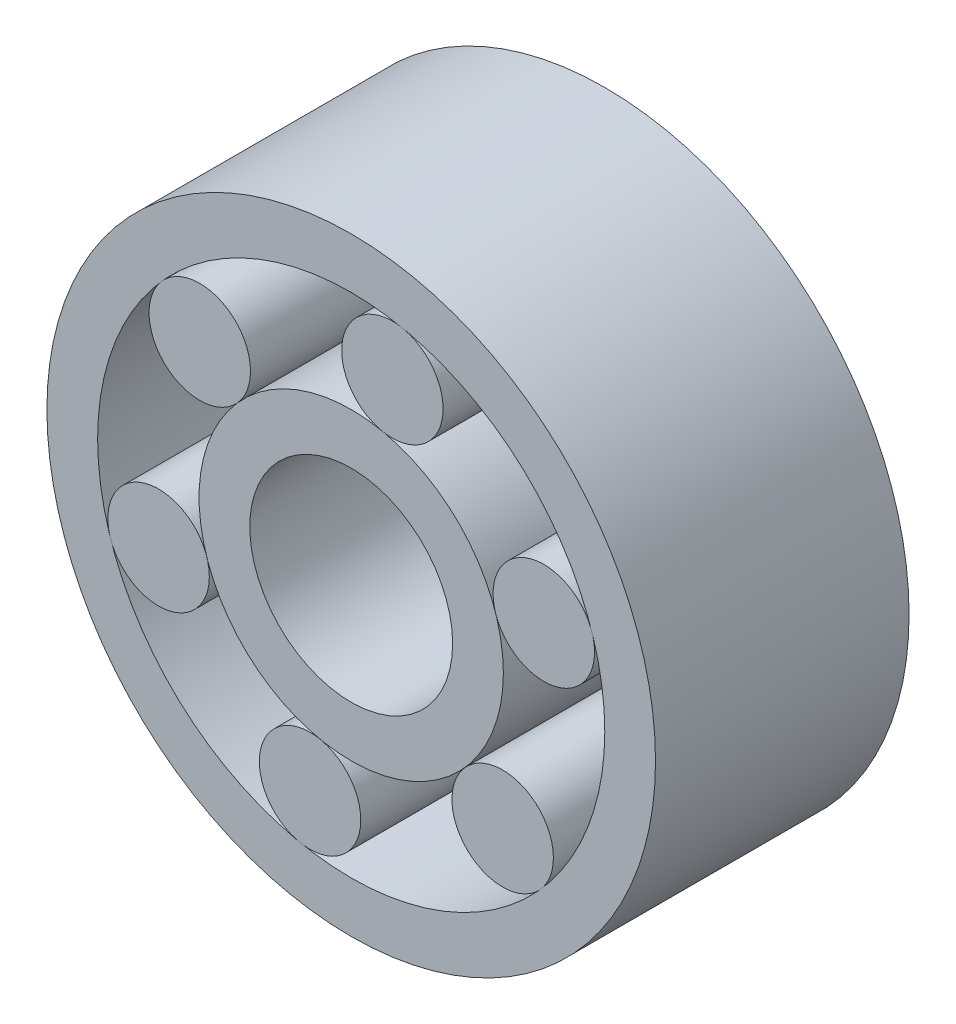
ISO-10303-21;
HEADER;
FILE_DESCRIPTION(('STEP AP214'),'2;1');
FILE_NAME('part.step','',(''),(''),'','','');
FILE_SCHEMA(('AUTOMOTIVE_DESIGN { 1 0 10303 214 1 1 1 1 }'));
ENDSEC;
DATA;
#1=APPLICATION_CONTEXT('core data for automotive mechanical design processes');
#2=APPLICATION_PROTOCOL_DEFINITION('international standard','automotive_design',2000,#1);
#3=PRODUCT_CONTEXT('',#1,'mechanical');
#4=PRODUCT('Part','Part','',(#3));
#5=PRODUCT_RELATED_PRODUCT_CATEGORY('part','',(#4));
#6=PRODUCT_DEFINITION_FORMATION('','',#4);
#7=PRODUCT_DEFINITION_CONTEXT('part definition',#1,'design');
#8=PRODUCT_DEFINITION('design','',#6,#7);
#9=PRODUCT_DEFINITION_SHAPE('','',#8);
#10=(LENGTH_UNIT() NAMED_UNIT(*) SI_UNIT(.MILLI.,.METRE.));
#11=(NAMED_UNIT(*) PLANE_ANGLE_UNIT() SI_UNIT($,.RADIAN.));
#12=(NAMED_UNIT(*) SI_UNIT($,.STERADIAN.) SOLID_ANGLE_UNIT());
#13=UNCERTAINTY_MEASURE_WITH_UNIT(LENGTH_MEASURE(1.E-05),#10,'distance_accuracy_value','');
#14=(GEOMETRIC_REPRESENTATION_CONTEXT(3) GLOBAL_UNCERTAINTY_ASSIGNED_CONTEXT((#13)) GLOBAL_UNIT_ASSIGNED_CONTEXT((#10,
#11,#12)) REPRESENTATION_CONTEXT('',''));
#15=CARTESIAN_POINT('',(0.,0.,0.));
#16=DIRECTION('',(0.,0.,1.));
#17=DIRECTION('',(1.,0.,0.));
#18=AXIS2_PLACEMENT_3D('',#15,#16,#17);
#19=CARTESIAN_POINT('',(-1.89893700826541,-0.627724651929273,2.5));
#20=DIRECTION('',(0.,0.,-1.));
#21=DIRECTION('',(-1.,0.,0.));
#22=AXIS2_PLACEMENT_3D('',#19,#20,#21);
#23=CYLINDRICAL_SURFACE('',#22,0.50000000000002);
#24=CARTESIAN_POINT('',(-1.89893700826541,-0.627724651929273,2.5));
#25=DIRECTION('',(0.,0.,1.));
#26=DIRECTION('',(1.,0.,0.));
#27=AXIS2_PLACEMENT_3D('',#24,#25,#26);
#28=CIRCLE('',#27,0.50000000000002);
#29=CARTESIAN_POINT('',(-1.39893700826539,-0.627724651929273,2.5));
#30=VERTEX_POINT('',#29);
#31=EDGE_CURVE('E12',#30,#30,#28,.T.);
#32=ORIENTED_EDGE('',*,*,#31,.F.);
#33=EDGE_LOOP('',(#32));
#34=FACE_BOUND('',#33,.T.);
#35=CARTESIAN_POINT('',(-1.89893700826541,-0.627724651929273,0.));
#36=DIRECTION('',(0.,0.,1.));
#37=DIRECTION('',(1.,0.,0.));
#38=AXIS2_PLACEMENT_3D('',#35,#36,#37);
#39=CIRCLE('',#38,0.50000000000002);
#40=CARTESIAN_POINT('',(-1.39893700826539,-0.627724651929273,0.));
#41=VERTEX_POINT('',#40);
#42=EDGE_CURVE('E57',#41,#41,#39,.T.);
#43=ORIENTED_EDGE('',*,*,#42,.T.);
#44=EDGE_LOOP('',(#43));
#45=FACE_BOUND('',#44,.T.);
#46=ADVANCED_FACE('F54',(#34,#45),#23,.T.);
#47=CARTESIAN_POINT('',(-1.89893700826541,-0.627724651929273,2.5));
#48=DIRECTION('',(0.,0.,1.));
#49=DIRECTION('',(1.,0.,0.));
#50=AXIS2_PLACEMENT_3D('',#47,#48,#49);
#51=PLANE('',#50);
#52=ORIENTED_EDGE('',*,*,#31,.T.);
#53=EDGE_LOOP('',(#52));
#54=FACE_BOUND('',#53,.T.);
#55=ADVANCED_FACE('F69',(#54),#51,.T.);
#56=CARTESIAN_POINT('',(-1.89893700826541,-0.627724651929273,0.));
#57=DIRECTION('',(0.,0.,1.));
#58=DIRECTION('',(1.,0.,0.));
#59=AXIS2_PLACEMENT_3D('',#56,#57,#58);
#60=PLANE('',#59);
#61=ORIENTED_EDGE('',*,*,#42,.F.);
#62=EDGE_LOOP('',(#61));
#63=FACE_BOUND('',#62,.T.);
#64=ADVANCED_FACE('F67',(#63),#60,.F.);
#65=CLOSED_SHELL('',(#46,#55,#64));
#66=MANIFOLD_SOLID_BREP('B2',#65);
#67=CARTESIAN_POINT('',(-0.405843008980126,-1.95839001530892,2.5));
#68=DIRECTION('',(0.,0.,-1.));
#69=DIRECTION('',(-1.,0.,0.));
#70=AXIS2_PLACEMENT_3D('',#67,#68,#69);
#71=CYLINDRICAL_SURFACE('',#70,0.500000000000088);
#72=CARTESIAN_POINT('',(-0.405843008980126,-1.95839001530892,2.5));
#73=DIRECTION('',(0.,0.,1.));
#74=DIRECTION('',(1.,0.,0.));
#75=AXIS2_PLACEMENT_3D('',#72,#73,#74);
#76=CIRCLE('',#75,0.500000000000088);
#77=CARTESIAN_POINT('',(0.094156991019962,-1.95839001530892,2.5));
#78=VERTEX_POINT('',#77);
#79=EDGE_CURVE('E53',#78,#78,#76,.T.);
#80=ORIENTED_EDGE('',*,*,#79,.F.);
#81=EDGE_LOOP('',(#80));
#82=FACE_BOUND('',#81,.T.);
#83=CARTESIAN_POINT('',(-0.405843008980126,-1.95839001530892,0.));
#84=DIRECTION('',(0.,0.,1.));
#85=DIRECTION('',(1.,0.,0.));
#86=AXIS2_PLACEMENT_3D('',#83,#84,#85);
#87=CIRCLE('',#86,0.500000000000088);
#88=CARTESIAN_POINT('',(0.094156991019962,-1.95839001530892,0.));
#89=VERTEX_POINT('',#88);
#90=EDGE_CURVE('E106',#89,#89,#87,.T.);
#91=ORIENTED_EDGE('',*,*,#90,.T.);
#92=EDGE_LOOP('',(#91));
#93=FACE_BOUND('',#92,.T.);
#94=ADVANCED_FACE('F103',(#82,#93),#71,.T.);
#95=CARTESIAN_POINT('',(-0.405843008980126,-1.95839001530892,2.5));
#96=DIRECTION('',(0.,0.,1.));
#97=DIRECTION('',(1.,0.,0.));
#98=AXIS2_PLACEMENT_3D('',#95,#96,#97);
#99=PLANE('',#98);
#100=ORIENTED_EDGE('',*,*,#79,.T.);
#101=EDGE_LOOP('',(#100));
#102=FACE_BOUND('',#101,.T.);
#103=ADVANCED_FACE('F118',(#102),#99,.T.);
#104=CARTESIAN_POINT('',(-0.405843008980126,-1.95839001530892,0.));
#105=DIRECTION('',(0.,0.,1.));
#106=DIRECTION('',(1.,0.,0.));
#107=AXIS2_PLACEMENT_3D('',#104,#105,#106);
#108=PLANE('',#107);
#109=ORIENTED_EDGE('',*,*,#90,.F.);
#110=EDGE_LOOP('',(#109));
#111=FACE_BOUND('',#110,.T.);
#112=ADVANCED_FACE('F116',(#111),#108,.F.);
#113=CLOSED_SHELL('',(#94,#103,#112));
#114=MANIFOLD_SOLID_BREP('B7',#113);
#115=CARTESIAN_POINT('',(1.49309399928534,-1.33066536337958,2.5));
#116=DIRECTION('',(0.,0.,-1.));
#117=DIRECTION('',(-1.,0.,0.));
#118=AXIS2_PLACEMENT_3D('',#115,#116,#117);
#119=CYLINDRICAL_SURFACE('',#118,0.500000000000158);
#120=CARTESIAN_POINT('',(1.49309399928534,-1.33066536337958,2.5));
#121=DIRECTION('',(0.,0.,1.));
#122=DIRECTION('',(1.,0.,0.));
#123=AXIS2_PLACEMENT_3D('',#120,#121,#122);
#124=CIRCLE('',#123,0.500000000000158);
#125=CARTESIAN_POINT('',(1.9930939992855,-1.33066536337958,2.5));
#126=VERTEX_POINT('',#125);
#127=EDGE_CURVE('E102',#126,#126,#124,.T.);
#128=ORIENTED_EDGE('',*,*,#127,.F.);
#129=EDGE_LOOP('',(#128));
#130=FACE_BOUND('',#129,.T.);
#131=CARTESIAN_POINT('',(1.49309399928534,-1.33066536337958,0.));
#132=DIRECTION('',(0.,0.,1.));
#133=DIRECTION('',(1.,0.,0.));
#134=AXIS2_PLACEMENT_3D('',#131,#132,#133);
#135=CIRCLE('',#134,0.500000000000158);
#136=CARTESIAN_POINT('',(1.9930939992855,-1.33066536337958,0.));
#137=VERTEX_POINT('',#136);
#138=EDGE_CURVE('E155',#137,#137,#135,.T.);
#139=ORIENTED_EDGE('',*,*,#138,.T.);
#140=EDGE_LOOP('',(#139));
#141=FACE_BOUND('',#140,.T.);
#142=ADVANCED_FACE('F152',(#130,#141),#119,.T.);
#143=CARTESIAN_POINT('',(1.49309399928534,-1.33066536337958,2.5));
#144=DIRECTION('',(0.,0.,1.));
#145=DIRECTION('',(1.,0.,0.));
#146=AXIS2_PLACEMENT_3D('',#143,#144,#145);
#147=PLANE('',#146);
#148=ORIENTED_EDGE('',*,*,#127,.T.);
#149=EDGE_LOOP('',(#148));
#150=FACE_BOUND('',#149,.T.);
#151=ADVANCED_FACE('F167',(#150),#147,.T.);
#152=CARTESIAN_POINT('',(1.49309399928534,-1.33066536337958,0.));
#153=DIRECTION('',(0.,0.,1.));
#154=DIRECTION('',(1.,0.,0.));
#155=AXIS2_PLACEMENT_3D('',#152,#153,#154);
#156=PLANE('',#155);
#157=ORIENTED_EDGE('',*,*,#138,.F.);
#158=EDGE_LOOP('',(#157));
#159=FACE_BOUND('',#158,.T.);
#160=ADVANCED_FACE('F165',(#159),#156,.F.);
#161=CLOSED_SHELL('',(#142,#151,#160));
#162=MANIFOLD_SOLID_BREP('B48',#161);
#163=CARTESIAN_POINT('',(1.89893700826552,0.627724651929399,2.5));
#164=DIRECTION('',(0.,0.,-1.));
#165=DIRECTION('',(-1.,0.,0.));
#166=AXIS2_PLACEMENT_3D('',#163,#164,#165);
#167=CYLINDRICAL_SURFACE('',#166,0.500000000000156);
#168=CARTESIAN_POINT('',(1.89893700826552,0.627724651929399,2.5));
#169=DIRECTION('',(0.,0.,1.));
#170=DIRECTION('',(1.,0.,0.));
#171=AXIS2_PLACEMENT_3D('',#168,#169,#170);
#172=CIRCLE('',#171,0.500000000000156);
#173=CARTESIAN_POINT('',(2.39893700826568,0.627724651929399,2.5));
#174=VERTEX_POINT('',#173);
#175=EDGE_CURVE('E151',#174,#174,#172,.T.);
#176=ORIENTED_EDGE('',*,*,#175,.F.);
#177=EDGE_LOOP('',(#176));
#178=FACE_BOUND('',#177,.T.);
#179=CARTESIAN_POINT('',(1.89893700826552,0.627724651929399,0.));
#180=DIRECTION('',(0.,0.,1.));
#181=DIRECTION('',(1.,0.,0.));
#182=AXIS2_PLACEMENT_3D('',#179,#180,#181);
#183=CIRCLE('',#182,0.500000000000156);
#184=CARTESIAN_POINT('',(2.39893700826568,0.627724651929399,0.));
#185=VERTEX_POINT('',#184);
#186=EDGE_CURVE('E204',#185,#185,#183,.T.);
#187=ORIENTED_EDGE('',*,*,#186,.T.);
#188=EDGE_LOOP('',(#187));
#189=FACE_BOUND('',#188,.T.);
#190=ADVANCED_FACE('F201',(#178,#189),#167,.T.);
#191=CARTESIAN_POINT('',(1.89893700826552,0.627724651929399,2.5));
#192=DIRECTION('',(0.,0.,1.));
#193=DIRECTION('',(1.,0.,0.));
#194=AXIS2_PLACEMENT_3D('',#191,#192,#193);
#195=PLANE('',#194);
#196=ORIENTED_EDGE('',*,*,#175,.T.);
#197=EDGE_LOOP('',(#196));
#198=FACE_BOUND('',#197,.T.);
#199=ADVANCED_FACE('F216',(#198),#195,.T.);
#200=CARTESIAN_POINT('',(1.89893700826552,0.627724651929399,0.));
#201=DIRECTION('',(0.,0.,1.));
#202=DIRECTION('',(1.,0.,0.));
#203=AXIS2_PLACEMENT_3D('',#200,#201,#202);
#204=PLANE('',#203);
#205=ORIENTED_EDGE('',*,*,#186,.F.);
#206=EDGE_LOOP('',(#205));
#207=FACE_BOUND('',#206,.T.);
#208=ADVANCED_FACE('F214',(#207),#204,.F.);
#209=CLOSED_SHELL('',(#190,#199,#208));
#210=MANIFOLD_SOLID_BREP('B97',#209);
#211=CARTESIAN_POINT('',(0.405843008980241,1.95839001530905,2.5));
#212=DIRECTION('',(0.,0.,-1.));
#213=DIRECTION('',(-1.,0.,0.));
#214=AXIS2_PLACEMENT_3D('',#211,#212,#213);
#215=CYLINDRICAL_SURFACE('',#214,0.500000000000079);
#216=CARTESIAN_POINT('',(0.405843008980241,1.95839001530905,2.5));
#217=DIRECTION('',(0.,0.,1.));
#218=DIRECTION('',(1.,0.,0.));
#219=AXIS2_PLACEMENT_3D('',#216,#217,#218);
#220=CIRCLE('',#219,0.500000000000079);
#221=CARTESIAN_POINT('',(0.90584300898032,1.95839001530905,2.5));
#222=VERTEX_POINT('',#221);
#223=EDGE_CURVE('E200',#222,#222,#220,.T.);
#224=ORIENTED_EDGE('',*,*,#223,.F.);
#225=EDGE_LOOP('',(#224));
#226=FACE_BOUND('',#225,.T.);
#227=CARTESIAN_POINT('',(0.405843008980241,1.95839001530905,0.));
#228=DIRECTION('',(0.,0.,1.));
#229=DIRECTION('',(1.,0.,0.));
#230=AXIS2_PLACEMENT_3D('',#227,#228,#229);
#231=CIRCLE('',#230,0.500000000000079);
#232=CARTESIAN_POINT('',(0.90584300898032,1.95839001530905,0.));
#233=VERTEX_POINT('',#232);
#234=EDGE_CURVE('E253',#233,#233,#231,.T.);
#235=ORIENTED_EDGE('',*,*,#234,.T.);
#236=EDGE_LOOP('',(#235));
#237=FACE_BOUND('',#236,.T.);
#238=ADVANCED_FACE('F250',(#226,#237),#215,.T.);
#239=CARTESIAN_POINT('',(0.405843008980241,1.95839001530905,2.5));
#240=DIRECTION('',(0.,0.,1.));
#241=DIRECTION('',(1.,0.,0.));
#242=AXIS2_PLACEMENT_3D('',#239,#240,#241);
#243=PLANE('',#242);
#244=ORIENTED_EDGE('',*,*,#223,.T.);
#245=EDGE_LOOP('',(#244));
#246=FACE_BOUND('',#245,.T.);
#247=ADVANCED_FACE('F265',(#246),#243,.T.);
#248=CARTESIAN_POINT('',(0.405843008980241,1.95839001530905,0.));
#249=DIRECTION('',(0.,0.,1.));
#250=DIRECTION('',(1.,0.,0.));
#251=AXIS2_PLACEMENT_3D('',#248,#249,#250);
#252=PLANE('',#251);
#253=ORIENTED_EDGE('',*,*,#234,.F.);
#254=EDGE_LOOP('',(#253));
#255=FACE_BOUND('',#254,.T.);
#256=ADVANCED_FACE('F263',(#255),#252,.F.);
#257=CLOSED_SHELL('',(#238,#247,#256));
#258=MANIFOLD_SOLID_BREP('B146',#257);
#259=CARTESIAN_POINT('',(-1.49309399928522,1.33066536337971,2.5));
#260=DIRECTION('',(0.,0.,-1.));
#261=DIRECTION('',(-1.,0.,0.));
#262=AXIS2_PLACEMENT_3D('',#259,#260,#261);
#263=CYLINDRICAL_SURFACE('',#262,0.5);
#264=CARTESIAN_POINT('',(-1.49309399928522,1.33066536337971,2.5));
#265=DIRECTION('',(0.,0.,1.));
#266=DIRECTION('',(1.,0.,0.));
#267=AXIS2_PLACEMENT_3D('',#264,#265,#266);
#268=CIRCLE('',#267,0.5);
#269=CARTESIAN_POINT('',(-0.993093999285224,1.33066536337971,2.5));
#270=VERTEX_POINT('',#269);
#271=EDGE_CURVE('E249',#270,#270,#268,.T.);
#272=ORIENTED_EDGE('',*,*,#271,.F.);
#273=EDGE_LOOP('',(#272));
#274=FACE_BOUND('',#273,.T.);
#275=CARTESIAN_POINT('',(-1.49309399928522,1.33066536337971,0.));
#276=DIRECTION('',(0.,0.,1.));
#277=DIRECTION('',(1.,0.,0.));
#278=AXIS2_PLACEMENT_3D('',#275,#276,#277);
#279=CIRCLE('',#278,0.5);
#280=CARTESIAN_POINT('',(-0.993093999285224,1.33066536337971,0.));
#281=VERTEX_POINT('',#280);
#282=EDGE_CURVE('E302',#281,#281,#279,.T.);
#283=ORIENTED_EDGE('',*,*,#282,.T.);
#284=EDGE_LOOP('',(#283));
#285=FACE_BOUND('',#284,.T.);
#286=ADVANCED_FACE('F299',(#274,#285),#263,.T.);
#287=CARTESIAN_POINT('',(-1.49309399928522,1.33066536337971,2.5));
#288=DIRECTION('',(0.,0.,1.));
#289=DIRECTION('',(1.,0.,0.));
#290=AXIS2_PLACEMENT_3D('',#287,#288,#289);
#291=PLANE('',#290);
#292=ORIENTED_EDGE('',*,*,#271,.T.);
#293=EDGE_LOOP('',(#292));
#294=FACE_BOUND('',#293,.T.);
#295=ADVANCED_FACE('F314',(#294),#291,.T.);
#296=CARTESIAN_POINT('',(-1.49309399928522,1.33066536337971,0.));
#297=DIRECTION('',(0.,0.,1.));
#298=DIRECTION('',(1.,0.,0.));
#299=AXIS2_PLACEMENT_3D('',#296,#297,#298);
#300=PLANE('',#299);
#301=ORIENTED_EDGE('',*,*,#282,.F.);
#302=EDGE_LOOP('',(#301));
#303=FACE_BOUND('',#302,.T.);
#304=ADVANCED_FACE('F312',(#303),#300,.F.);
#305=CLOSED_SHELL('',(#286,#295,#304));
#306=MANIFOLD_SOLID_BREP('B195',#305);
#307=CARTESIAN_POINT('',(0.,0.,2.5));
#308=DIRECTION('',(0.,0.,-1.));
#309=DIRECTION('',(-1.,0.,0.));
#310=AXIS2_PLACEMENT_3D('',#307,#308,#309);
#311=CYLINDRICAL_SURFACE('',#310,1.);
#312=CARTESIAN_POINT('',(0.,0.,2.5));
#313=DIRECTION('',(0.,0.,1.));
#314=DIRECTION('',(1.,0.,0.));
#315=AXIS2_PLACEMENT_3D('',#312,#313,#314);
#316=CIRCLE('',#315,1.);
#317=CARTESIAN_POINT('',(1.,0.,2.5));
#318=VERTEX_POINT('',#317);
#319=EDGE_CURVE('E354',#318,#318,#316,.T.);
#320=ORIENTED_EDGE('',*,*,#319,.T.);
#321=EDGE_LOOP('',(#320));
#322=FACE_BOUND('',#321,.T.);
#323=CARTESIAN_POINT('',(0.,0.,0.));
#324=DIRECTION('',(0.,0.,1.));
#325=DIRECTION('',(1.,0.,0.));
#326=AXIS2_PLACEMENT_3D('',#323,#324,#325);
#327=CIRCLE('',#326,1.);
#328=CARTESIAN_POINT('',(1.,0.,0.));
#329=VERTEX_POINT('',#328);
#330=EDGE_CURVE('E360',#329,#329,#327,.T.);
#331=ORIENTED_EDGE('',*,*,#330,.F.);
#332=EDGE_LOOP('',(#331));
#333=FACE_BOUND('',#332,.T.);
#334=ADVANCED_FACE('F347',(#322,#333),#311,.F.);
#335=CARTESIAN_POINT('',(0.,0.,2.5));
#336=DIRECTION('',(0.,0.,-1.));
#337=DIRECTION('',(-1.,0.,0.));
#338=AXIS2_PLACEMENT_3D('',#335,#336,#337);
#339=CYLINDRICAL_SURFACE('',#338,1.5);
#340=CARTESIAN_POINT('',(0.,0.,0.));
#341=DIRECTION('',(0.,0.,1.));
#342=DIRECTION('',(1.,0.,0.));
#343=AXIS2_PLACEMENT_3D('',#340,#341,#342);
#344=CIRCLE('',#343,1.5);
#345=CARTESIAN_POINT('',(1.5,0.,0.));
#346=VERTEX_POINT('',#345);
#347=EDGE_CURVE('E350',#346,#346,#344,.T.);
#348=ORIENTED_EDGE('',*,*,#347,.T.);
#349=EDGE_LOOP('',(#348));
#350=FACE_BOUND('',#349,.T.);
#351=CARTESIAN_POINT('',(0.,0.,2.5));
#352=DIRECTION('',(0.,0.,1.));
#353=DIRECTION('',(1.,0.,0.));
#354=AXIS2_PLACEMENT_3D('',#351,#352,#353);
#355=CIRCLE('',#354,1.5);
#356=CARTESIAN_POINT('',(1.5,0.,2.5));
#357=VERTEX_POINT('',#356);
#358=EDGE_CURVE('E298',#357,#357,#355,.T.);
#359=ORIENTED_EDGE('',*,*,#358,.F.);
#360=EDGE_LOOP('',(#359));
#361=FACE_BOUND('',#360,.T.);
#362=ADVANCED_FACE('F367',(#350,#361),#339,.T.);
#363=CARTESIAN_POINT('',(0.,0.,2.5));
#364=DIRECTION('',(0.,0.,1.));
#365=DIRECTION('',(1.,0.,0.));
#366=AXIS2_PLACEMENT_3D('',#363,#364,#365);
#367=PLANE('',#366);
#368=ORIENTED_EDGE('',*,*,#319,.F.);
#369=EDGE_LOOP('',(#368));
#370=FACE_BOUND('',#369,.T.);
#371=ORIENTED_EDGE('',*,*,#358,.T.);
#372=EDGE_LOOP('',(#371));
#373=FACE_BOUND('',#372,.T.);
#374=ADVANCED_FACE('F372',(#370,#373),#367,.T.);
#375=CARTESIAN_POINT('',(0.,0.,0.));
#376=DIRECTION('',(0.,0.,1.));
#377=DIRECTION('',(1.,0.,0.));
#378=AXIS2_PLACEMENT_3D('',#375,#376,#377);
#379=PLANE('',#378);
#380=ORIENTED_EDGE('',*,*,#330,.T.);
#381=EDGE_LOOP('',(#380));
#382=FACE_BOUND('',#381,.T.);
#383=ORIENTED_EDGE('',*,*,#347,.F.);
#384=EDGE_LOOP('',(#383));
#385=FACE_BOUND('',#384,.T.);
#386=ADVANCED_FACE('F370',(#382,#385),#379,.F.);
#387=CLOSED_SHELL('',(#334,#362,#374,#386));
#388=MANIFOLD_SOLID_BREP('B244',#387);
#389=CARTESIAN_POINT('',(0.,0.,2.5));
#390=DIRECTION('',(0.,0.,-1.));
#391=DIRECTION('',(-1.,0.,0.));
#392=AXIS2_PLACEMENT_3D('',#389,#390,#391);
#393=CYLINDRICAL_SURFACE('',#392,2.5);
#394=CARTESIAN_POINT('',(0.,0.,0.));
#395=DIRECTION('',(0.,0.,1.));
#396=DIRECTION('',(1.,0.,0.));
#397=AXIS2_PLACEMENT_3D('',#394,#395,#396);
#398=CIRCLE('',#397,2.5);
#399=CARTESIAN_POINT('',(2.5,0.,0.));
#400=VERTEX_POINT('',#399);
#401=EDGE_CURVE('E418',#400,#400,#398,.T.);
#402=ORIENTED_EDGE('',*,*,#401,.F.);
#403=EDGE_LOOP('',(#402));
#404=FACE_BOUND('',#403,.T.);
#405=CARTESIAN_POINT('',(0.,0.,2.5));
#406=DIRECTION('',(0.,0.,1.));
#407=DIRECTION('',(1.,0.,0.));
#408=AXIS2_PLACEMENT_3D('',#405,#406,#407);
#409=CIRCLE('',#408,2.5);
#410=CARTESIAN_POINT('',(2.5,0.,2.5));
#411=VERTEX_POINT('',#410);
#412=EDGE_CURVE('E411',#411,#411,#409,.T.);
#413=ORIENTED_EDGE('',*,*,#412,.T.);
#414=EDGE_LOOP('',(#413));
#415=FACE_BOUND('',#414,.T.);
#416=ADVANCED_FACE('F403',(#404,#415),#393,.F.);
#417=CARTESIAN_POINT('',(0.,0.,2.5));
#418=DIRECTION('',(0.,0.,-1.));
#419=DIRECTION('',(-1.,0.,0.));
#420=AXIS2_PLACEMENT_3D('',#417,#418,#419);
#421=CYLINDRICAL_SURFACE('',#420,3.);
#422=CARTESIAN_POINT('',(0.,0.,2.5));
#423=DIRECTION('',(0.,0.,1.));
#424=DIRECTION('',(1.,0.,0.));
#425=AXIS2_PLACEMENT_3D('',#422,#423,#424);
#426=CIRCLE('',#425,3.);
#427=CARTESIAN_POINT('',(3.,0.,2.5));
#428=VERTEX_POINT('',#427);
#429=EDGE_CURVE('E346',#428,#428,#426,.T.);
#430=ORIENTED_EDGE('',*,*,#429,.F.);
#431=EDGE_LOOP('',(#430));
#432=FACE_BOUND('',#431,.T.);
#433=CARTESIAN_POINT('',(0.,0.,0.));
#434=DIRECTION('',(0.,0.,1.));
#435=DIRECTION('',(1.,0.,0.));
#436=AXIS2_PLACEMENT_3D('',#433,#434,#435);
#437=CIRCLE('',#436,3.);
#438=CARTESIAN_POINT('',(3.,0.,0.));
#439=VERTEX_POINT('',#438);
#440=EDGE_CURVE('E406',#439,#439,#437,.T.);
#441=ORIENTED_EDGE('',*,*,#440,.T.);
#442=EDGE_LOOP('',(#441));
#443=FACE_BOUND('',#442,.T.);
#444=ADVANCED_FACE('F427',(#432,#443),#421,.T.);
#445=CARTESIAN_POINT('',(0.,0.,2.5));
#446=DIRECTION('',(0.,0.,1.));
#447=DIRECTION('',(1.,0.,0.));
#448=AXIS2_PLACEMENT_3D('',#445,#446,#447);
#449=PLANE('',#448);
#450=ORIENTED_EDGE('',*,*,#412,.F.);
#451=EDGE_LOOP('',(#450));
#452=FACE_BOUND('',#451,.T.);
#453=ORIENTED_EDGE('',*,*,#429,.T.);
#454=EDGE_LOOP('',(#453));
#455=FACE_BOUND('',#454,.T.);
#456=ADVANCED_FACE('F431',(#452,#455),#449,.T.);
#457=CARTESIAN_POINT('',(0.,0.,0.));
#458=DIRECTION('',(0.,0.,1.));
#459=DIRECTION('',(1.,0.,0.));
#460=AXIS2_PLACEMENT_3D('',#457,#458,#459);
#461=PLANE('',#460);
#462=ORIENTED_EDGE('',*,*,#401,.T.);
#463=EDGE_LOOP('',(#462));
#464=FACE_BOUND('',#463,.T.);
#465=ORIENTED_EDGE('',*,*,#440,.F.);
#466=EDGE_LOOP('',(#465));
#467=FACE_BOUND('',#466,.T.);
#468=ADVANCED_FACE('F429',(#464,#467),#461,.F.);
#469=CLOSED_SHELL('',(#416,#444,#456,#468));
#470=MANIFOLD_SOLID_BREP('B293',#469);
#471=ADVANCED_BREP_SHAPE_REPRESENTATION('',(#18,#66,#114,#162,#210,#258,#306,#388,#470),#14);
#472=SHAPE_DEFINITION_REPRESENTATION(#9,#471);
ENDSEC;
END-ISO-10303-21;
